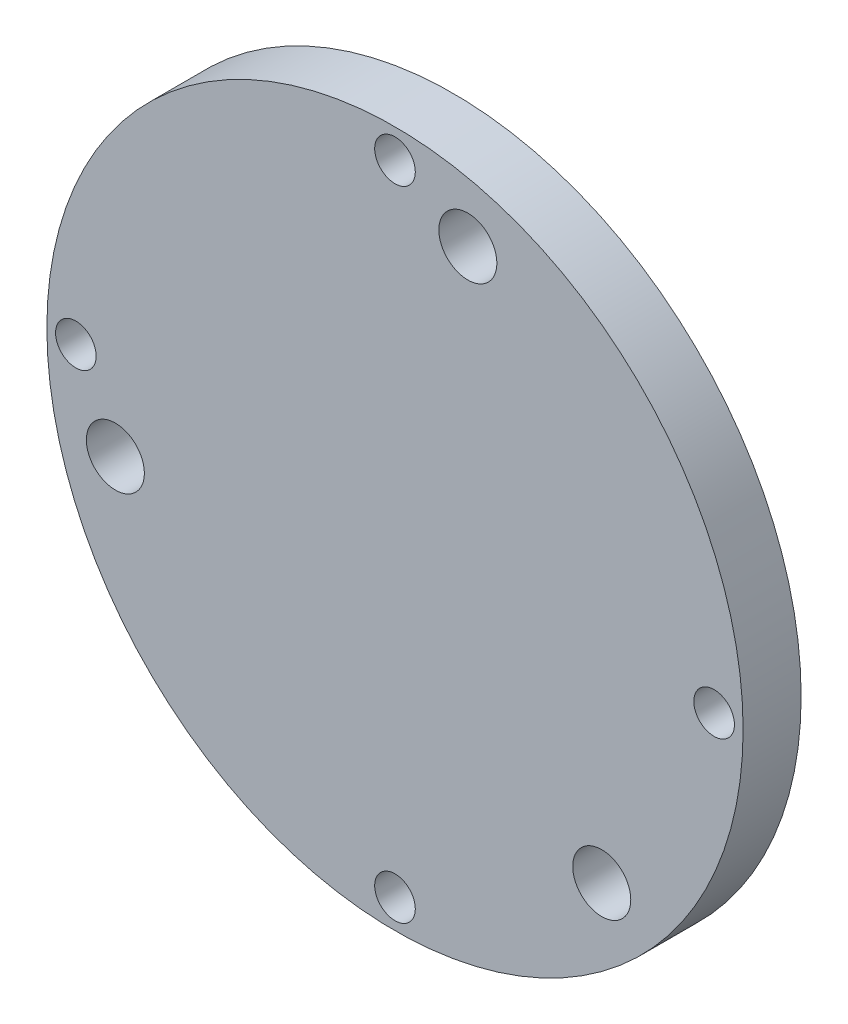
ISO-10303-21;
HEADER;
FILE_DESCRIPTION(('STEP AP214'),'2;1');
FILE_NAME('part.step','',(''),(''),'','','');
FILE_SCHEMA(('AUTOMOTIVE_DESIGN { 1 0 10303 214 1 1 1 1 }'));
ENDSEC;
DATA;
#1=APPLICATION_CONTEXT('core data for automotive mechanical design processes');
#2=APPLICATION_PROTOCOL_DEFINITION('international standard','automotive_design',2000,#1);
#3=PRODUCT_CONTEXT('',#1,'mechanical');
#4=PRODUCT('Part','Part','',(#3));
#5=PRODUCT_RELATED_PRODUCT_CATEGORY('part','',(#4));
#6=PRODUCT_DEFINITION_FORMATION('','',#4);
#7=PRODUCT_DEFINITION_CONTEXT('part definition',#1,'design');
#8=PRODUCT_DEFINITION('design','',#6,#7);
#9=PRODUCT_DEFINITION_SHAPE('','',#8);
#10=(LENGTH_UNIT() NAMED_UNIT(*) SI_UNIT(.MILLI.,.METRE.));
#11=(NAMED_UNIT(*) PLANE_ANGLE_UNIT() SI_UNIT($,.RADIAN.));
#12=(NAMED_UNIT(*) SI_UNIT($,.STERADIAN.) SOLID_ANGLE_UNIT());
#13=UNCERTAINTY_MEASURE_WITH_UNIT(LENGTH_MEASURE(1.E-05),#10,'distance_accuracy_value','');
#14=(GEOMETRIC_REPRESENTATION_CONTEXT(3) GLOBAL_UNCERTAINTY_ASSIGNED_CONTEXT((#13)) GLOBAL_UNIT_ASSIGNED_CONTEXT((#10,
#11,#12)) REPRESENTATION_CONTEXT('',''));
#15=CARTESIAN_POINT('',(0.,0.,0.));
#16=DIRECTION('',(0.,0.,1.));
#17=DIRECTION('',(1.,0.,0.));
#18=AXIS2_PLACEMENT_3D('',#15,#16,#17);
#19=CARTESIAN_POINT('',(0.,27.5,5.));
#20=DIRECTION('',(0.,0.,-1.));
#21=DIRECTION('',(-1.,0.,0.));
#22=AXIS2_PLACEMENT_3D('',#19,#20,#21);
#23=CYLINDRICAL_SURFACE('',#22,1.75);
#24=CARTESIAN_POINT('',(0.,27.5,5.));
#25=DIRECTION('',(0.,0.,1.));
#26=DIRECTION('',(1.,0.,0.));
#27=AXIS2_PLACEMENT_3D('',#24,#25,#26);
#28=CIRCLE('',#27,1.75);
#29=CARTESIAN_POINT('',(1.75,27.5,5.));
#30=VERTEX_POINT('',#29);
#31=EDGE_CURVE('E39',#30,#30,#28,.T.);
#32=ORIENTED_EDGE('',*,*,#31,.T.);
#33=EDGE_LOOP('',(#32));
#34=FACE_BOUND('',#33,.T.);
#35=CARTESIAN_POINT('',(0.,27.5,0.));
#36=DIRECTION('',(0.,0.,1.));
#37=DIRECTION('',(1.,0.,0.));
#38=AXIS2_PLACEMENT_3D('',#35,#36,#37);
#39=CIRCLE('',#38,1.75);
#40=CARTESIAN_POINT('',(1.75,27.5,0.));
#41=VERTEX_POINT('',#40);
#42=EDGE_CURVE('E65',#41,#41,#39,.T.);
#43=ORIENTED_EDGE('',*,*,#42,.F.);
#44=EDGE_LOOP('',(#43));
#45=FACE_BOUND('',#44,.T.);
#46=ADVANCED_FACE('F31',(#34,#45),#23,.F.);
#47=CARTESIAN_POINT('',(27.5000000000008,7.6245695125434E-13,5.));
#48=DIRECTION('',(0.,0.,-1.));
#49=DIRECTION('',(-1.,0.,0.));
#50=AXIS2_PLACEMENT_3D('',#47,#48,#49);
#51=CYLINDRICAL_SURFACE('',#50,1.75);
#52=CARTESIAN_POINT('',(27.5000000000008,7.6245695125434E-13,5.));
#53=DIRECTION('',(0.,0.,1.));
#54=DIRECTION('',(1.,0.,0.));
#55=AXIS2_PLACEMENT_3D('',#52,#53,#54);
#56=CIRCLE('',#55,1.75);
#57=CARTESIAN_POINT('',(29.2500000000008,7.6245695125434E-13,5.));
#58=VERTEX_POINT('',#57);
#59=EDGE_CURVE('E44',#58,#58,#56,.T.);
#60=ORIENTED_EDGE('',*,*,#59,.T.);
#61=EDGE_LOOP('',(#60));
#62=FACE_BOUND('',#61,.T.);
#63=CARTESIAN_POINT('',(27.5000000000008,7.6245695125434E-13,0.));
#64=DIRECTION('',(0.,0.,1.));
#65=DIRECTION('',(1.,0.,0.));
#66=AXIS2_PLACEMENT_3D('',#63,#64,#65);
#67=CIRCLE('',#66,1.75);
#68=CARTESIAN_POINT('',(29.2500000000008,7.6245695125434E-13,0.));
#69=VERTEX_POINT('',#68);
#70=EDGE_CURVE('E63',#69,#69,#67,.T.);
#71=ORIENTED_EDGE('',*,*,#70,.F.);
#72=EDGE_LOOP('',(#71));
#73=FACE_BOUND('',#72,.T.);
#74=ADVANCED_FACE('F92',(#62,#73),#51,.F.);
#75=CARTESIAN_POINT('',(1.52491390250868E-12,-27.5,5.));
#76=DIRECTION('',(0.,0.,-1.));
#77=DIRECTION('',(-1.,0.,0.));
#78=AXIS2_PLACEMENT_3D('',#75,#76,#77);
#79=CYLINDRICAL_SURFACE('',#78,1.75);
#80=CARTESIAN_POINT('',(1.52491390250868E-12,-27.5,5.));
#81=DIRECTION('',(0.,0.,1.));
#82=DIRECTION('',(1.,0.,0.));
#83=AXIS2_PLACEMENT_3D('',#80,#81,#82);
#84=CIRCLE('',#83,1.75);
#85=CARTESIAN_POINT('',(1.75000000000153,-27.5,5.));
#86=VERTEX_POINT('',#85);
#87=EDGE_CURVE('E87',#86,#86,#84,.T.);
#88=ORIENTED_EDGE('',*,*,#87,.T.);
#89=EDGE_LOOP('',(#88));
#90=FACE_BOUND('',#89,.T.);
#91=CARTESIAN_POINT('',(1.52491390250868E-12,-27.5,0.));
#92=DIRECTION('',(0.,0.,1.));
#93=DIRECTION('',(1.,0.,0.));
#94=AXIS2_PLACEMENT_3D('',#91,#92,#93);
#95=CIRCLE('',#94,1.75);
#96=CARTESIAN_POINT('',(1.75000000000153,-27.5,0.));
#97=VERTEX_POINT('',#96);
#98=EDGE_CURVE('E60',#97,#97,#95,.T.);
#99=ORIENTED_EDGE('',*,*,#98,.F.);
#100=EDGE_LOOP('',(#99));
#101=FACE_BOUND('',#100,.T.);
#102=ADVANCED_FACE('F110',(#90,#101),#79,.F.);
#103=CARTESIAN_POINT('',(-27.4999999999992,-7.65824729951995E-13,5.));
#104=DIRECTION('',(0.,0.,-1.));
#105=DIRECTION('',(-1.,0.,0.));
#106=AXIS2_PLACEMENT_3D('',#103,#104,#105);
#107=CYLINDRICAL_SURFACE('',#106,1.75);
#108=CARTESIAN_POINT('',(-27.4999999999992,-7.65824729951995E-13,5.));
#109=DIRECTION('',(0.,0.,1.));
#110=DIRECTION('',(1.,0.,0.));
#111=AXIS2_PLACEMENT_3D('',#108,#109,#110);
#112=CIRCLE('',#111,1.75);
#113=CARTESIAN_POINT('',(-25.7499999999992,-7.65824729951995E-13,5.));
#114=VERTEX_POINT('',#113);
#115=EDGE_CURVE('E84',#114,#114,#112,.T.);
#116=ORIENTED_EDGE('',*,*,#115,.T.);
#117=EDGE_LOOP('',(#116));
#118=FACE_BOUND('',#117,.T.);
#119=CARTESIAN_POINT('',(-27.4999999999992,-7.65824729951995E-13,0.));
#120=DIRECTION('',(0.,0.,1.));
#121=DIRECTION('',(1.,0.,0.));
#122=AXIS2_PLACEMENT_3D('',#119,#120,#121);
#123=CIRCLE('',#122,1.75);
#124=CARTESIAN_POINT('',(-25.7499999999992,-7.65824729951995E-13,0.));
#125=VERTEX_POINT('',#124);
#126=EDGE_CURVE('E57',#125,#125,#123,.T.);
#127=ORIENTED_EDGE('',*,*,#126,.F.);
#128=EDGE_LOOP('',(#127));
#129=FACE_BOUND('',#128,.T.);
#130=ADVANCED_FACE('F117',(#118,#129),#107,.F.);
#131=CARTESIAN_POINT('',(-24.096024686195,-6.66195123985742,5.));
#132=DIRECTION('',(0.,0.,-1.));
#133=DIRECTION('',(-1.,0.,0.));
#134=AXIS2_PLACEMENT_3D('',#131,#132,#133);
#135=CYLINDRICAL_SURFACE('',#134,2.50000000000206);
#136=CARTESIAN_POINT('',(-24.096024686195,-6.66195123985742,5.));
#137=DIRECTION('',(0.,0.,1.));
#138=DIRECTION('',(1.,0.,0.));
#139=AXIS2_PLACEMENT_3D('',#136,#137,#138);
#140=CIRCLE('',#139,2.50000000000206);
#141=CARTESIAN_POINT('',(-21.5960246861929,-6.66195123985742,5.));
#142=VERTEX_POINT('',#141);
#143=EDGE_CURVE('E79',#142,#142,#140,.T.);
#144=ORIENTED_EDGE('',*,*,#143,.T.);
#145=EDGE_LOOP('',(#144));
#146=FACE_BOUND('',#145,.T.);
#147=CARTESIAN_POINT('',(-24.096024686195,-6.66195123985742,0.));
#148=DIRECTION('',(0.,0.,1.));
#149=DIRECTION('',(1.,0.,0.));
#150=AXIS2_PLACEMENT_3D('',#147,#148,#149);
#151=CIRCLE('',#150,2.50000000000206);
#152=CARTESIAN_POINT('',(-21.5960246861929,-6.66195123985742,0.));
#153=VERTEX_POINT('',#152);
#154=EDGE_CURVE('E54',#153,#153,#151,.T.);
#155=ORIENTED_EDGE('',*,*,#154,.F.);
#156=EDGE_LOOP('',(#155));
#157=FACE_BOUND('',#156,.T.);
#158=ADVANCED_FACE('F121',(#146,#157),#135,.F.);
#159=CARTESIAN_POINT('',(6.27859333060951,24.198745128391,5.));
#160=DIRECTION('',(0.,0.,-1.));
#161=DIRECTION('',(-1.,0.,0.));
#162=AXIS2_PLACEMENT_3D('',#159,#160,#161);
#163=CYLINDRICAL_SURFACE('',#162,2.5);
#164=CARTESIAN_POINT('',(6.27859333060951,24.198745128391,5.));
#165=DIRECTION('',(0.,0.,1.));
#166=DIRECTION('',(1.,0.,0.));
#167=AXIS2_PLACEMENT_3D('',#164,#165,#166);
#168=CIRCLE('',#167,2.5);
#169=CARTESIAN_POINT('',(8.77859333060951,24.198745128391,5.));
#170=VERTEX_POINT('',#169);
#171=EDGE_CURVE('E74',#170,#170,#168,.T.);
#172=ORIENTED_EDGE('',*,*,#171,.T.);
#173=EDGE_LOOP('',(#172));
#174=FACE_BOUND('',#173,.T.);
#175=CARTESIAN_POINT('',(6.27859333060951,24.198745128391,0.));
#176=DIRECTION('',(0.,0.,1.));
#177=DIRECTION('',(1.,0.,0.));
#178=AXIS2_PLACEMENT_3D('',#175,#176,#177);
#179=CIRCLE('',#178,2.5);
#180=CARTESIAN_POINT('',(8.77859333060951,24.198745128391,0.));
#181=VERTEX_POINT('',#180);
#182=EDGE_CURVE('E51',#181,#181,#179,.T.);
#183=ORIENTED_EDGE('',*,*,#182,.F.);
#184=EDGE_LOOP('',(#183));
#185=FACE_BOUND('',#184,.T.);
#186=ADVANCED_FACE('F124',(#174,#185),#163,.F.);
#187=CARTESIAN_POINT('',(17.8174313555885,-17.5367938885344,5.));
#188=DIRECTION('',(0.,0.,-1.));
#189=DIRECTION('',(-1.,0.,0.));
#190=AXIS2_PLACEMENT_3D('',#187,#188,#189);
#191=CYLINDRICAL_SURFACE('',#190,2.50000000000096);
#192=CARTESIAN_POINT('',(17.8174313555885,-17.5367938885344,5.));
#193=DIRECTION('',(0.,0.,1.));
#194=DIRECTION('',(1.,0.,0.));
#195=AXIS2_PLACEMENT_3D('',#192,#193,#194);
#196=CIRCLE('',#195,2.50000000000096);
#197=CARTESIAN_POINT('',(20.3174313555895,-17.5367938885344,5.));
#198=VERTEX_POINT('',#197);
#199=EDGE_CURVE('E70',#198,#198,#196,.T.);
#200=ORIENTED_EDGE('',*,*,#199,.T.);
#201=EDGE_LOOP('',(#200));
#202=FACE_BOUND('',#201,.T.);
#203=CARTESIAN_POINT('',(17.8174313555885,-17.5367938885344,0.));
#204=DIRECTION('',(0.,0.,1.));
#205=DIRECTION('',(1.,0.,0.));
#206=AXIS2_PLACEMENT_3D('',#203,#204,#205);
#207=CIRCLE('',#206,2.50000000000096);
#208=CARTESIAN_POINT('',(20.3174313555895,-17.5367938885344,0.));
#209=VERTEX_POINT('',#208);
#210=EDGE_CURVE('E48',#209,#209,#207,.T.);
#211=ORIENTED_EDGE('',*,*,#210,.F.);
#212=EDGE_LOOP('',(#211));
#213=FACE_BOUND('',#212,.T.);
#214=ADVANCED_FACE('F33',(#202,#213),#191,.F.);
#215=CARTESIAN_POINT('',(0.,0.,5.));
#216=DIRECTION('',(0.,0.,-1.));
#217=DIRECTION('',(-1.,0.,0.));
#218=AXIS2_PLACEMENT_3D('',#215,#216,#217);
#219=CYLINDRICAL_SURFACE('',#218,30.);
#220=CARTESIAN_POINT('',(0.,0.,5.));
#221=DIRECTION('',(0.,0.,1.));
#222=DIRECTION('',(1.,0.,0.));
#223=AXIS2_PLACEMENT_3D('',#220,#221,#222);
#224=CIRCLE('',#223,30.);
#225=CARTESIAN_POINT('',(30.,0.,5.));
#226=VERTEX_POINT('',#225);
#227=EDGE_CURVE('E10',#226,#226,#224,.T.);
#228=ORIENTED_EDGE('',*,*,#227,.F.);
#229=EDGE_LOOP('',(#228));
#230=FACE_BOUND('',#229,.T.);
#231=CARTESIAN_POINT('',(0.,0.,0.));
#232=DIRECTION('',(0.,0.,1.));
#233=DIRECTION('',(1.,0.,0.));
#234=AXIS2_PLACEMENT_3D('',#231,#232,#233);
#235=CIRCLE('',#234,30.);
#236=CARTESIAN_POINT('',(30.,0.,0.));
#237=VERTEX_POINT('',#236);
#238=EDGE_CURVE('E35',#237,#237,#235,.T.);
#239=ORIENTED_EDGE('',*,*,#238,.T.);
#240=EDGE_LOOP('',(#239));
#241=FACE_BOUND('',#240,.T.);
#242=ADVANCED_FACE('F99',(#230,#241),#219,.T.);
#243=CARTESIAN_POINT('',(0.,0.,5.));
#244=DIRECTION('',(0.,0.,1.));
#245=DIRECTION('',(1.,0.,0.));
#246=AXIS2_PLACEMENT_3D('',#243,#244,#245);
#247=PLANE('',#246);
#248=ORIENTED_EDGE('',*,*,#199,.F.);
#249=EDGE_LOOP('',(#248));
#250=FACE_BOUND('',#249,.T.);
#251=ORIENTED_EDGE('',*,*,#171,.F.);
#252=EDGE_LOOP('',(#251));
#253=FACE_BOUND('',#252,.T.);
#254=ORIENTED_EDGE('',*,*,#143,.F.);
#255=EDGE_LOOP('',(#254));
#256=FACE_BOUND('',#255,.T.);
#257=ORIENTED_EDGE('',*,*,#115,.F.);
#258=EDGE_LOOP('',(#257));
#259=FACE_BOUND('',#258,.T.);
#260=ORIENTED_EDGE('',*,*,#87,.F.);
#261=EDGE_LOOP('',(#260));
#262=FACE_BOUND('',#261,.T.);
#263=ORIENTED_EDGE('',*,*,#59,.F.);
#264=EDGE_LOOP('',(#263));
#265=FACE_BOUND('',#264,.T.);
#266=ORIENTED_EDGE('',*,*,#31,.F.);
#267=EDGE_LOOP('',(#266));
#268=FACE_BOUND('',#267,.T.);
#269=ORIENTED_EDGE('',*,*,#227,.T.);
#270=EDGE_LOOP('',(#269));
#271=FACE_BOUND('',#270,.T.);
#272=ADVANCED_FACE('F95',(#250,#253,#256,#259,#262,#265,#268,#271),#247,.T.);
#273=CARTESIAN_POINT('',(0.,0.,0.));
#274=DIRECTION('',(0.,0.,1.));
#275=DIRECTION('',(1.,0.,0.));
#276=AXIS2_PLACEMENT_3D('',#273,#274,#275);
#277=PLANE('',#276);
#278=ORIENTED_EDGE('',*,*,#210,.T.);
#279=EDGE_LOOP('',(#278));
#280=FACE_BOUND('',#279,.T.);
#281=ORIENTED_EDGE('',*,*,#182,.T.);
#282=EDGE_LOOP('',(#281));
#283=FACE_BOUND('',#282,.T.);
#284=ORIENTED_EDGE('',*,*,#154,.T.);
#285=EDGE_LOOP('',(#284));
#286=FACE_BOUND('',#285,.T.);
#287=ORIENTED_EDGE('',*,*,#126,.T.);
#288=EDGE_LOOP('',(#287));
#289=FACE_BOUND('',#288,.T.);
#290=ORIENTED_EDGE('',*,*,#98,.T.);
#291=EDGE_LOOP('',(#290));
#292=FACE_BOUND('',#291,.T.);
#293=ORIENTED_EDGE('',*,*,#70,.T.);
#294=EDGE_LOOP('',(#293));
#295=FACE_BOUND('',#294,.T.);
#296=ORIENTED_EDGE('',*,*,#42,.T.);
#297=EDGE_LOOP('',(#296));
#298=FACE_BOUND('',#297,.T.);
#299=ORIENTED_EDGE('',*,*,#238,.F.);
#300=EDGE_LOOP('',(#299));
#301=FACE_BOUND('',#300,.T.);
#302=ADVANCED_FACE('F98',(#280,#283,#286,#289,#292,#295,#298,#301),#277,.F.);
#303=CLOSED_SHELL('',(#46,#74,#102,#130,#158,#186,#214,#242,#272,#302));
#304=MANIFOLD_SOLID_BREP('B2',#303);
#305=ADVANCED_BREP_SHAPE_REPRESENTATION('',(#18,#304),#14);
#306=SHAPE_DEFINITION_REPRESENTATION(#9,#305);
ENDSEC;
END-ISO-10303-21;
